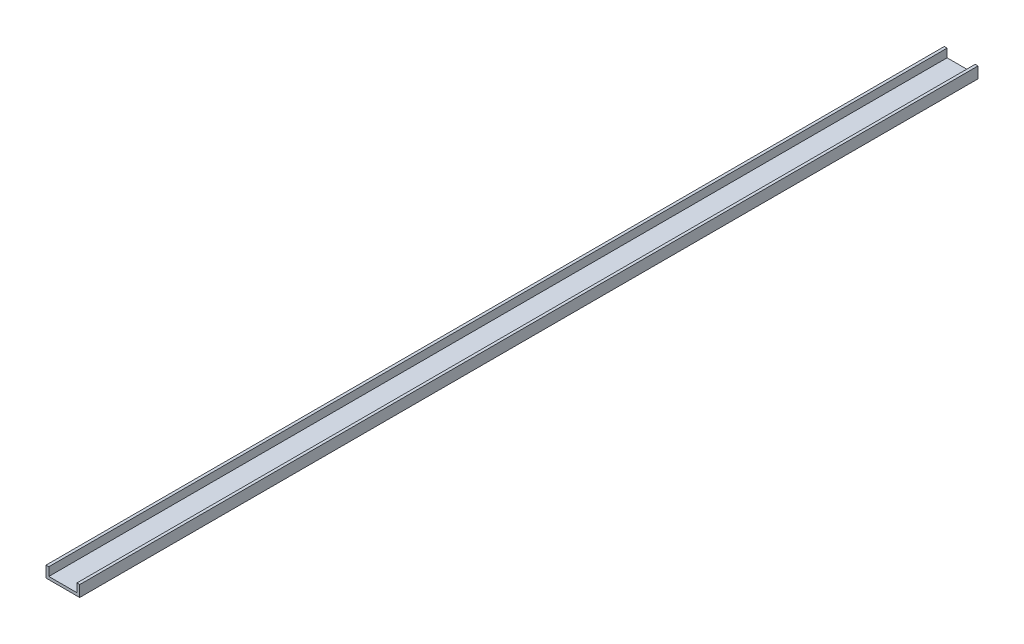
ISO-10303-21;
HEADER;
FILE_DESCRIPTION(('STEP AP214'),'2;1');
FILE_NAME('part.step','',(''),(''),'','','');
FILE_SCHEMA(('AUTOMOTIVE_DESIGN { 1 0 10303 214 1 1 1 1 }'));
ENDSEC;
DATA;
#1=APPLICATION_CONTEXT('core data for automotive mechanical design processes');
#2=APPLICATION_PROTOCOL_DEFINITION('international standard','automotive_design',2000,#1);
#3=PRODUCT_CONTEXT('',#1,'mechanical');
#4=PRODUCT('Part','Part','',(#3));
#5=PRODUCT_RELATED_PRODUCT_CATEGORY('part','',(#4));
#6=PRODUCT_DEFINITION_FORMATION('','',#4);
#7=PRODUCT_DEFINITION_CONTEXT('part definition',#1,'design');
#8=PRODUCT_DEFINITION('design','',#6,#7);
#9=PRODUCT_DEFINITION_SHAPE('','',#8);
#10=(LENGTH_UNIT() NAMED_UNIT(*) SI_UNIT(.MILLI.,.METRE.));
#11=(NAMED_UNIT(*) PLANE_ANGLE_UNIT() SI_UNIT($,.RADIAN.));
#12=(NAMED_UNIT(*) SI_UNIT($,.STERADIAN.) SOLID_ANGLE_UNIT());
#13=UNCERTAINTY_MEASURE_WITH_UNIT(LENGTH_MEASURE(1.E-05),#10,'distance_accuracy_value','');
#14=(GEOMETRIC_REPRESENTATION_CONTEXT(3) GLOBAL_UNCERTAINTY_ASSIGNED_CONTEXT((#13)) GLOBAL_UNIT_ASSIGNED_CONTEXT((#10,
#11,#12)) REPRESENTATION_CONTEXT('',''));
#15=CARTESIAN_POINT('',(0.,0.,0.));
#16=DIRECTION('',(0.,0.,1.));
#17=DIRECTION('',(1.,0.,0.));
#18=AXIS2_PLACEMENT_3D('',#15,#16,#17);
#19=CARTESIAN_POINT('',(0.,0.,1016.));
#20=DIRECTION('',(1.,0.,0.));
#21=DIRECTION('',(0.,0.,-1.));
#22=AXIS2_PLACEMENT_3D('',#19,#20,#21);
#23=PLANE('',#22);
#24=DIRECTION('',(0.,-1.,0.));
#25=VECTOR('',#24,1.);
#26=CARTESIAN_POINT('',(0.,0.,0.));
#27=LINE('',#26,#25);
#28=CARTESIAN_POINT('',(0.,12.7,0.));
#29=VERTEX_POINT('',#28);
#30=CARTESIAN_POINT('',(0.,0.,0.));
#31=VERTEX_POINT('',#30);
#32=EDGE_CURVE('E129',#29,#31,#27,.T.);
#33=ORIENTED_EDGE('',*,*,#32,.T.);
#34=DIRECTION('',(0.,0.,-1.));
#35=VECTOR('',#34,1.);
#36=CARTESIAN_POINT('',(0.,0.,1016.));
#37=LINE('',#36,#35);
#38=CARTESIAN_POINT('',(0.,0.,1016.));
#39=VERTEX_POINT('',#38);
#40=EDGE_CURVE('E11',#39,#31,#37,.T.);
#41=ORIENTED_EDGE('',*,*,#40,.F.);
#42=DIRECTION('',(0.,-1.,0.));
#43=VECTOR('',#42,1.);
#44=CARTESIAN_POINT('',(0.,0.,1016.));
#45=LINE('',#44,#43);
#46=CARTESIAN_POINT('',(0.,12.7,1016.));
#47=VERTEX_POINT('',#46);
#48=EDGE_CURVE('E143',#47,#39,#45,.T.);
#49=ORIENTED_EDGE('',*,*,#48,.F.);
#50=DIRECTION('',(0.,0.,-1.));
#51=VECTOR('',#50,1.);
#52=CARTESIAN_POINT('',(0.,12.7,1016.));
#53=LINE('',#52,#51);
#54=EDGE_CURVE('E125',#47,#29,#53,.T.);
#55=ORIENTED_EDGE('',*,*,#54,.T.);
#56=EDGE_LOOP('',(#33,#41,#49,#55));
#57=FACE_BOUND('',#56,.T.);
#58=ADVANCED_FACE('F33',(#57),#23,.F.);
#59=CARTESIAN_POINT('',(0.,0.,1016.));
#60=DIRECTION('',(0.,1.,0.));
#61=DIRECTION('',(0.,0.,1.));
#62=AXIS2_PLACEMENT_3D('',#59,#60,#61);
#63=PLANE('',#62);
#64=DIRECTION('',(1.,0.,0.));
#65=VECTOR('',#64,1.);
#66=CARTESIAN_POINT('',(0.,0.,0.));
#67=LINE('',#66,#65);
#68=CARTESIAN_POINT('',(38.1,0.,0.));
#69=VERTEX_POINT('',#68);
#70=EDGE_CURVE('E132',#31,#69,#67,.T.);
#71=ORIENTED_EDGE('',*,*,#70,.T.);
#72=DIRECTION('',(0.,0.,-1.));
#73=VECTOR('',#72,1.);
#74=CARTESIAN_POINT('',(38.1,0.,1016.));
#75=LINE('',#74,#73);
#76=CARTESIAN_POINT('',(38.1,0.,1016.));
#77=VERTEX_POINT('',#76);
#78=EDGE_CURVE('E41',#77,#69,#75,.T.);
#79=ORIENTED_EDGE('',*,*,#78,.F.);
#80=DIRECTION('',(1.,0.,0.));
#81=VECTOR('',#80,1.);
#82=CARTESIAN_POINT('',(0.,0.,1016.));
#83=LINE('',#82,#81);
#84=EDGE_CURVE('E92',#39,#77,#83,.T.);
#85=ORIENTED_EDGE('',*,*,#84,.F.);
#86=ORIENTED_EDGE('',*,*,#40,.T.);
#87=EDGE_LOOP('',(#71,#79,#85,#86));
#88=FACE_BOUND('',#87,.T.);
#89=ADVANCED_FACE('F178',(#88),#63,.F.);
#90=CARTESIAN_POINT('',(38.1,0.,1016.));
#91=DIRECTION('',(-1.,0.,0.));
#92=DIRECTION('',(0.,0.,1.));
#93=AXIS2_PLACEMENT_3D('',#90,#91,#92);
#94=PLANE('',#93);
#95=DIRECTION('',(0.,1.,0.));
#96=VECTOR('',#95,1.);
#97=CARTESIAN_POINT('',(38.1,0.,0.));
#98=LINE('',#97,#96);
#99=CARTESIAN_POINT('',(38.1,12.7,0.));
#100=VERTEX_POINT('',#99);
#101=EDGE_CURVE('E134',#69,#100,#98,.T.);
#102=ORIENTED_EDGE('',*,*,#101,.T.);
#103=DIRECTION('',(0.,0.,-1.));
#104=VECTOR('',#103,1.);
#105=CARTESIAN_POINT('',(38.1,12.7,1016.));
#106=LINE('',#105,#104);
#107=CARTESIAN_POINT('',(38.1,12.7,1016.));
#108=VERTEX_POINT('',#107);
#109=EDGE_CURVE('E150',#108,#100,#106,.T.);
#110=ORIENTED_EDGE('',*,*,#109,.F.);
#111=DIRECTION('',(0.,1.,0.));
#112=VECTOR('',#111,1.);
#113=CARTESIAN_POINT('',(38.1,0.,1016.));
#114=LINE('',#113,#112);
#115=EDGE_CURVE('E158',#77,#108,#114,.T.);
#116=ORIENTED_EDGE('',*,*,#115,.F.);
#117=ORIENTED_EDGE('',*,*,#78,.T.);
#118=EDGE_LOOP('',(#102,#110,#116,#117));
#119=FACE_BOUND('',#118,.T.);
#120=ADVANCED_FACE('F156',(#119),#94,.F.);
#121=CARTESIAN_POINT('',(38.1,12.7,1016.));
#122=DIRECTION('',(0.,-1.,0.));
#123=DIRECTION('',(0.,0.,-1.));
#124=AXIS2_PLACEMENT_3D('',#121,#122,#123);
#125=PLANE('',#124);
#126=DIRECTION('',(-1.,0.,0.));
#127=VECTOR('',#126,1.);
#128=CARTESIAN_POINT('',(38.1,12.7,0.));
#129=LINE('',#128,#127);
#130=CARTESIAN_POINT('',(34.925,12.7,0.));
#131=VERTEX_POINT('',#130);
#132=EDGE_CURVE('E136',#100,#131,#129,.T.);
#133=ORIENTED_EDGE('',*,*,#132,.T.);
#134=DIRECTION('',(0.,0.,-1.));
#135=VECTOR('',#134,1.);
#136=CARTESIAN_POINT('',(34.925,12.7,1016.));
#137=LINE('',#136,#135);
#138=CARTESIAN_POINT('',(34.925,12.7,1016.));
#139=VERTEX_POINT('',#138);
#140=EDGE_CURVE('E147',#139,#131,#137,.T.);
#141=ORIENTED_EDGE('',*,*,#140,.F.);
#142=DIRECTION('',(-1.,0.,0.));
#143=VECTOR('',#142,1.);
#144=CARTESIAN_POINT('',(38.1,12.7,1016.));
#145=LINE('',#144,#143);
#146=EDGE_CURVE('E170',#108,#139,#145,.T.);
#147=ORIENTED_EDGE('',*,*,#146,.F.);
#148=ORIENTED_EDGE('',*,*,#109,.T.);
#149=EDGE_LOOP('',(#133,#141,#147,#148));
#150=FACE_BOUND('',#149,.T.);
#151=ADVANCED_FACE('F166',(#150),#125,.F.);
#152=CARTESIAN_POINT('',(34.925,3.175,1016.));
#153=DIRECTION('',(1.,0.,0.));
#154=DIRECTION('',(0.,0.,-1.));
#155=AXIS2_PLACEMENT_3D('',#152,#153,#154);
#156=PLANE('',#155);
#157=DIRECTION('',(0.,-1.,0.));
#158=VECTOR('',#157,1.);
#159=CARTESIAN_POINT('',(34.925,3.175,0.));
#160=LINE('',#159,#158);
#161=CARTESIAN_POINT('',(34.925,3.175,0.));
#162=VERTEX_POINT('',#161);
#163=EDGE_CURVE('E138',#131,#162,#160,.T.);
#164=ORIENTED_EDGE('',*,*,#163,.T.);
#165=DIRECTION('',(0.,0.,-1.));
#166=VECTOR('',#165,1.);
#167=CARTESIAN_POINT('',(34.925,3.175,1016.));
#168=LINE('',#167,#166);
#169=CARTESIAN_POINT('',(34.925,3.175,1016.));
#170=VERTEX_POINT('',#169);
#171=EDGE_CURVE('E120',#170,#162,#168,.T.);
#172=ORIENTED_EDGE('',*,*,#171,.F.);
#173=DIRECTION('',(0.,-1.,0.));
#174=VECTOR('',#173,1.);
#175=CARTESIAN_POINT('',(34.925,3.175,1016.));
#176=LINE('',#175,#174);
#177=EDGE_CURVE('E111',#139,#170,#176,.T.);
#178=ORIENTED_EDGE('',*,*,#177,.F.);
#179=ORIENTED_EDGE('',*,*,#140,.T.);
#180=EDGE_LOOP('',(#164,#172,#178,#179));
#181=FACE_BOUND('',#180,.T.);
#182=ADVANCED_FACE('F169',(#181),#156,.F.);
#183=CARTESIAN_POINT('',(3.175,3.175,1016.));
#184=DIRECTION('',(0.,-1.,0.));
#185=DIRECTION('',(0.,0.,-1.));
#186=AXIS2_PLACEMENT_3D('',#183,#184,#185);
#187=PLANE('',#186);
#188=DIRECTION('',(-1.,0.,0.));
#189=VECTOR('',#188,1.);
#190=CARTESIAN_POINT('',(3.175,3.175,0.));
#191=LINE('',#190,#189);
#192=CARTESIAN_POINT('',(3.175,3.175,0.));
#193=VERTEX_POINT('',#192);
#194=EDGE_CURVE('E119',#162,#193,#191,.T.);
#195=ORIENTED_EDGE('',*,*,#194,.T.);
#196=DIRECTION('',(0.,0.,-1.));
#197=VECTOR('',#196,1.);
#198=CARTESIAN_POINT('',(3.175,3.175,1016.));
#199=LINE('',#198,#197);
#200=CARTESIAN_POINT('',(3.175,3.175,1016.));
#201=VERTEX_POINT('',#200);
#202=EDGE_CURVE('E116',#201,#193,#199,.T.);
#203=ORIENTED_EDGE('',*,*,#202,.F.);
#204=DIRECTION('',(-1.,0.,0.));
#205=VECTOR('',#204,1.);
#206=CARTESIAN_POINT('',(3.175,3.175,1016.));
#207=LINE('',#206,#205);
#208=EDGE_CURVE('E105',#170,#201,#207,.T.);
#209=ORIENTED_EDGE('',*,*,#208,.F.);
#210=ORIENTED_EDGE('',*,*,#171,.T.);
#211=EDGE_LOOP('',(#195,#203,#209,#210));
#212=FACE_BOUND('',#211,.T.);
#213=ADVANCED_FACE('F117',(#212),#187,.F.);
#214=CARTESIAN_POINT('',(3.175,3.175,1016.));
#215=DIRECTION('',(-1.,0.,0.));
#216=DIRECTION('',(0.,0.,1.));
#217=AXIS2_PLACEMENT_3D('',#214,#215,#216);
#218=PLANE('',#217);
#219=DIRECTION('',(0.,1.,0.));
#220=VECTOR('',#219,1.);
#221=CARTESIAN_POINT('',(3.175,3.175,0.));
#222=LINE('',#221,#220);
#223=CARTESIAN_POINT('',(3.175,12.7,0.));
#224=VERTEX_POINT('',#223);
#225=EDGE_CURVE('E78',#193,#224,#222,.T.);
#226=ORIENTED_EDGE('',*,*,#225,.T.);
#227=DIRECTION('',(0.,0.,-1.));
#228=VECTOR('',#227,1.);
#229=CARTESIAN_POINT('',(3.175,12.7,1016.));
#230=LINE('',#229,#228);
#231=CARTESIAN_POINT('',(3.175,12.7,1016.));
#232=VERTEX_POINT('',#231);
#233=EDGE_CURVE('E121',#232,#224,#230,.T.);
#234=ORIENTED_EDGE('',*,*,#233,.F.);
#235=DIRECTION('',(0.,1.,0.));
#236=VECTOR('',#235,1.);
#237=CARTESIAN_POINT('',(3.175,3.175,1016.));
#238=LINE('',#237,#236);
#239=EDGE_CURVE('E109',#201,#232,#238,.T.);
#240=ORIENTED_EDGE('',*,*,#239,.F.);
#241=ORIENTED_EDGE('',*,*,#202,.T.);
#242=EDGE_LOOP('',(#226,#234,#240,#241));
#243=FACE_BOUND('',#242,.T.);
#244=ADVANCED_FACE('F123',(#243),#218,.F.);
#245=CARTESIAN_POINT('',(0.,12.7,1016.));
#246=DIRECTION('',(0.,-1.,0.));
#247=DIRECTION('',(0.,0.,-1.));
#248=AXIS2_PLACEMENT_3D('',#245,#246,#247);
#249=PLANE('',#248);
#250=DIRECTION('',(-1.,0.,0.));
#251=VECTOR('',#250,1.);
#252=CARTESIAN_POINT('',(0.,12.7,0.));
#253=LINE('',#252,#251);
#254=EDGE_CURVE('E84',#224,#29,#253,.T.);
#255=ORIENTED_EDGE('',*,*,#254,.T.);
#256=ORIENTED_EDGE('',*,*,#54,.F.);
#257=DIRECTION('',(-1.,0.,0.));
#258=VECTOR('',#257,1.);
#259=CARTESIAN_POINT('',(0.,12.7,1016.));
#260=LINE('',#259,#258);
#261=EDGE_CURVE('E49',#232,#47,#260,.T.);
#262=ORIENTED_EDGE('',*,*,#261,.F.);
#263=ORIENTED_EDGE('',*,*,#233,.T.);
#264=EDGE_LOOP('',(#255,#256,#262,#263));
#265=FACE_BOUND('',#264,.T.);
#266=ADVANCED_FACE('F194',(#265),#249,.F.);
#267=CARTESIAN_POINT('',(0.,0.,1016.));
#268=DIRECTION('',(0.,0.,-1.));
#269=DIRECTION('',(-1.,0.,0.));
#270=AXIS2_PLACEMENT_3D('',#267,#268,#269);
#271=PLANE('',#270);
#272=ORIENTED_EDGE('',*,*,#48,.T.);
#273=ORIENTED_EDGE('',*,*,#84,.T.);
#274=ORIENTED_EDGE('',*,*,#115,.T.);
#275=ORIENTED_EDGE('',*,*,#146,.T.);
#276=ORIENTED_EDGE('',*,*,#177,.T.);
#277=ORIENTED_EDGE('',*,*,#208,.T.);
#278=ORIENTED_EDGE('',*,*,#239,.T.);
#279=ORIENTED_EDGE('',*,*,#261,.T.);
#280=EDGE_LOOP('',(#272,#273,#274,#275,#276,#277,#278,#279));
#281=FACE_BOUND('',#280,.T.);
#282=ADVANCED_FACE('F107',(#281),#271,.F.);
#283=CARTESIAN_POINT('',(0.,0.,0.));
#284=DIRECTION('',(0.,0.,-1.));
#285=DIRECTION('',(-1.,0.,0.));
#286=AXIS2_PLACEMENT_3D('',#283,#284,#285);
#287=PLANE('',#286);
#288=ORIENTED_EDGE('',*,*,#32,.F.);
#289=ORIENTED_EDGE('',*,*,#254,.F.);
#290=ORIENTED_EDGE('',*,*,#225,.F.);
#291=ORIENTED_EDGE('',*,*,#194,.F.);
#292=ORIENTED_EDGE('',*,*,#163,.F.);
#293=ORIENTED_EDGE('',*,*,#132,.F.);
#294=ORIENTED_EDGE('',*,*,#101,.F.);
#295=ORIENTED_EDGE('',*,*,#70,.F.);
#296=EDGE_LOOP('',(#288,#289,#290,#291,#292,#293,#294,#295));
#297=FACE_BOUND('',#296,.T.);
#298=ADVANCED_FACE('F162',(#297),#287,.T.);
#299=CLOSED_SHELL('',(#58,#89,#120,#151,#182,#213,#244,#266,#282,#298));
#300=MANIFOLD_SOLID_BREP('B2',#299);
#301=ADVANCED_BREP_SHAPE_REPRESENTATION('',(#18,#300),#14);
#302=SHAPE_DEFINITION_REPRESENTATION(#9,#301);
ENDSEC;
END-ISO-10303-21;
